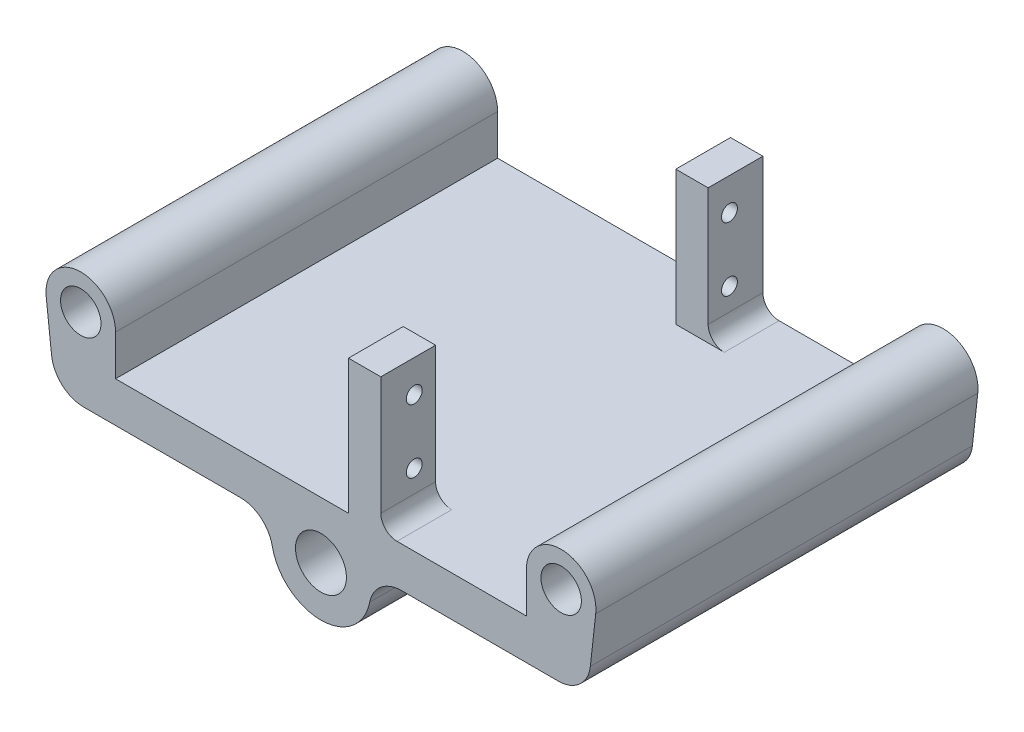
ISO-10303-21;
HEADER;
FILE_DESCRIPTION(('STEP AP214'),'2;1');
FILE_NAME('part.step','',(''),(''),'','','');
FILE_SCHEMA(('AUTOMOTIVE_DESIGN { 1 0 10303 214 1 1 1 1 }'));
ENDSEC;
DATA;
#1=APPLICATION_CONTEXT('core data for automotive mechanical design processes');
#2=APPLICATION_PROTOCOL_DEFINITION('international standard','automotive_design',2000,#1);
#3=PRODUCT_CONTEXT('',#1,'mechanical');
#4=PRODUCT('Part','Part','',(#3));
#5=PRODUCT_RELATED_PRODUCT_CATEGORY('part','',(#4));
#6=PRODUCT_DEFINITION_FORMATION('','',#4);
#7=PRODUCT_DEFINITION_CONTEXT('part definition',#1,'design');
#8=PRODUCT_DEFINITION('design','',#6,#7);
#9=PRODUCT_DEFINITION_SHAPE('','',#8);
#10=(LENGTH_UNIT() NAMED_UNIT(*) SI_UNIT(.MILLI.,.METRE.));
#11=(NAMED_UNIT(*) PLANE_ANGLE_UNIT() SI_UNIT($,.RADIAN.));
#12=(NAMED_UNIT(*) SI_UNIT($,.STERADIAN.) SOLID_ANGLE_UNIT());
#13=UNCERTAINTY_MEASURE_WITH_UNIT(LENGTH_MEASURE(1.E-05),#10,'distance_accuracy_value','');
#14=(GEOMETRIC_REPRESENTATION_CONTEXT(3) GLOBAL_UNCERTAINTY_ASSIGNED_CONTEXT((#13)) GLOBAL_UNIT_ASSIGNED_CONTEXT((#10,
#11,#12)) REPRESENTATION_CONTEXT('',''));
#15=CARTESIAN_POINT('',(0.,0.,0.));
#16=DIRECTION('',(0.,0.,1.));
#17=DIRECTION('',(1.,0.,0.));
#18=AXIS2_PLACEMENT_3D('',#15,#16,#17);
#19=CARTESIAN_POINT('',(32.258,6.35,60.));
#20=DIRECTION('',(0.,-1.,0.));
#21=DIRECTION('',(1.,0.,0.));
#22=AXIS2_PLACEMENT_3D('',#19,#20,#21);
#23=PLANE('',#22);
#24=DIRECTION('',(-1.,0.,0.));
#25=VECTOR('',#24,1.);
#26=CARTESIAN_POINT('',(32.258,6.35,0.));
#27=LINE('',#26,#25);
#28=CARTESIAN_POINT('',(32.258,6.35,0.));
#29=VERTEX_POINT('',#28);
#30=CARTESIAN_POINT('',(11.938,6.35,0.));
#31=VERTEX_POINT('',#30);
#32=EDGE_CURVE('E312',#29,#31,#27,.T.);
#33=ORIENTED_EDGE('',*,*,#32,.T.);
#34=DIRECTION('',(0.,0.,-1.));
#35=VECTOR('',#34,1.);
#36=CARTESIAN_POINT('',(11.938,6.35,8.6));
#37=LINE('',#36,#35);
#38=CARTESIAN_POINT('',(11.938,6.35,8.6));
#39=VERTEX_POINT('',#38);
#40=EDGE_CURVE('E346',#31,#39,#37,.F.);
#41=ORIENTED_EDGE('',*,*,#40,.T.);
#42=DIRECTION('',(1.,0.,0.));
#43=VECTOR('',#42,1.);
#44=CARTESIAN_POINT('',(4.31799999999999,6.35,8.6));
#45=LINE('',#44,#43);
#46=CARTESIAN_POINT('',(4.31799999999999,6.35,8.6));
#47=VERTEX_POINT('',#46);
#48=EDGE_CURVE('E226',#47,#39,#45,.T.);
#49=ORIENTED_EDGE('',*,*,#48,.F.);
#50=DIRECTION('',(0.,0.,1.));
#51=VECTOR('',#50,1.);
#52=CARTESIAN_POINT('',(4.31799999999998,6.35,0.));
#53=LINE('',#52,#51);
#54=CARTESIAN_POINT('',(4.31799999999998,6.35,0.));
#55=VERTEX_POINT('',#54);
#56=EDGE_CURVE('E223',#55,#47,#53,.T.);
#57=ORIENTED_EDGE('',*,*,#56,.F.);
#58=CARTESIAN_POINT('',(-32.258,6.35,0.));
#59=VERTEX_POINT('',#58);
#60=EDGE_CURVE('E330',#55,#59,#27,.T.);
#61=ORIENTED_EDGE('',*,*,#60,.T.);
#62=DIRECTION('',(0.,0.,-1.));
#63=VECTOR('',#62,1.);
#64=CARTESIAN_POINT('',(-32.258,6.35,60.));
#65=LINE('',#64,#63);
#66=CARTESIAN_POINT('',(-32.258,6.35,60.));
#67=VERTEX_POINT('',#66);
#68=EDGE_CURVE('E287',#67,#59,#65,.T.);
#69=ORIENTED_EDGE('',*,*,#68,.F.);
#70=DIRECTION('',(-1.,0.,0.));
#71=VECTOR('',#70,1.);
#72=CARTESIAN_POINT('',(32.258,6.35,60.));
#73=LINE('',#72,#71);
#74=CARTESIAN_POINT('',(4.31799999999998,6.35,60.));
#75=VERTEX_POINT('',#74);
#76=EDGE_CURVE('E318',#75,#67,#73,.T.);
#77=ORIENTED_EDGE('',*,*,#76,.F.);
#78=DIRECTION('',(0.,0.,1.));
#79=VECTOR('',#78,1.);
#80=CARTESIAN_POINT('',(4.31799999999999,6.35,51.4));
#81=LINE('',#80,#79);
#82=CARTESIAN_POINT('',(4.31799999999999,6.35,51.4));
#83=VERTEX_POINT('',#82);
#84=EDGE_CURVE('E222',#83,#75,#81,.T.);
#85=ORIENTED_EDGE('',*,*,#84,.F.);
#86=DIRECTION('',(-1.,0.,0.));
#87=VECTOR('',#86,1.);
#88=CARTESIAN_POINT('',(4.31799999999999,6.35,51.4));
#89=LINE('',#88,#87);
#90=CARTESIAN_POINT('',(11.938,6.35,51.4));
#91=VERTEX_POINT('',#90);
#92=EDGE_CURVE('E218',#91,#83,#89,.T.);
#93=ORIENTED_EDGE('',*,*,#92,.F.);
#94=DIRECTION('',(0.,0.,-1.));
#95=VECTOR('',#94,1.);
#96=CARTESIAN_POINT('',(11.938,6.35,60.));
#97=LINE('',#96,#95);
#98=CARTESIAN_POINT('',(11.938,6.35,60.));
#99=VERTEX_POINT('',#98);
#100=EDGE_CURVE('E344',#91,#99,#97,.F.);
#101=ORIENTED_EDGE('',*,*,#100,.T.);
#102=CARTESIAN_POINT('',(32.258,6.35,60.));
#103=VERTEX_POINT('',#102);
#104=EDGE_CURVE('E319',#103,#99,#73,.T.);
#105=ORIENTED_EDGE('',*,*,#104,.F.);
#106=DIRECTION('',(0.,0.,-1.));
#107=VECTOR('',#106,1.);
#108=CARTESIAN_POINT('',(32.258,6.35,60.));
#109=LINE('',#108,#107);
#110=EDGE_CURVE('E322',#103,#29,#109,.T.);
#111=ORIENTED_EDGE('',*,*,#110,.T.);
#112=EDGE_LOOP('',(#33,#41,#49,#57,#61,#69,#77,#85,#93,#101,#105,#111));
#113=FACE_BOUND('',#112,.T.);
#114=ADVANCED_FACE('F36',(#113),#23,.F.);
#115=CARTESIAN_POINT('',(0.,0.,60.));
#116=DIRECTION('',(0.,-1.,0.));
#117=DIRECTION('',(0.,0.,-1.));
#118=AXIS2_PLACEMENT_3D('',#115,#116,#117);
#119=PLANE('',#118);
#120=DIRECTION('',(-1.,0.,0.));
#121=VECTOR('',#120,1.);
#122=CARTESIAN_POINT('',(0.,0.,60.));
#123=LINE('',#122,#121);
#124=CARTESIAN_POINT('',(-12.6372663183143,0.,60.));
#125=VERTEX_POINT('',#124);
#126=CARTESIAN_POINT('',(-37.2549490920751,0.,60.));
#127=VERTEX_POINT('',#126);
#128=EDGE_CURVE('E270',#125,#127,#123,.T.);
#129=ORIENTED_EDGE('',*,*,#128,.T.);
#130=DIRECTION('',(0.,0.,-1.));
#131=VECTOR('',#130,1.);
#132=CARTESIAN_POINT('',(-37.2549490920751,0.,60.));
#133=LINE('',#132,#131);
#134=CARTESIAN_POINT('',(-37.2549490920751,0.,0.));
#135=VERTEX_POINT('',#134);
#136=EDGE_CURVE('E379',#127,#135,#133,.T.);
#137=ORIENTED_EDGE('',*,*,#136,.T.);
#138=DIRECTION('',(-1.,0.,0.));
#139=VECTOR('',#138,1.);
#140=CARTESIAN_POINT('',(0.,0.,0.));
#141=LINE('',#140,#139);
#142=CARTESIAN_POINT('',(-12.6372663183143,0.,0.));
#143=VERTEX_POINT('',#142);
#144=EDGE_CURVE('E265',#143,#135,#141,.T.);
#145=ORIENTED_EDGE('',*,*,#144,.F.);
#146=DIRECTION('',(0.,0.,1.));
#147=VECTOR('',#146,1.);
#148=CARTESIAN_POINT('',(-12.6372663183143,0.,60.));
#149=LINE('',#148,#147);
#150=EDGE_CURVE('E366',#143,#125,#149,.T.);
#151=ORIENTED_EDGE('',*,*,#150,.T.);
#152=EDGE_LOOP('',(#129,#137,#145,#151));
#153=FACE_BOUND('',#152,.T.);
#154=ADVANCED_FACE('F504',(#153),#119,.T.);
#155=CARTESIAN_POINT('',(37.719,12.7,60.));
#156=DIRECTION('',(0.,0.,1.));
#157=DIRECTION('',(1.,0.,0.));
#158=AXIS2_PLACEMENT_3D('',#155,#156,#157);
#159=PLANE('',#158);
#160=DIRECTION('',(-0.110525955178562,0.99387323800969,0.));
#161=VECTOR('',#160,1.);
#162=CARTESIAN_POINT('',(-41.8013318448109,0.,60.));
#163=LINE('',#162,#161);
#164=CARTESIAN_POINT('',(-42.3038251411643,4.5185281476929,60.));
#165=VERTEX_POINT('',#164);
#166=CARTESIAN_POINT('',(-43.1465417527709,12.0964177587699,60.));
#167=VERTEX_POINT('',#166);
#168=EDGE_CURVE('E268',#165,#167,#163,.T.);
#169=ORIENTED_EDGE('',*,*,#168,.F.);
#170=CARTESIAN_POINT('',(-37.2549490920751,5.08,60.));
#171=DIRECTION('',(0.,0.,1.));
#172=DIRECTION('',(1.,0.,0.));
#173=AXIS2_PLACEMENT_3D('',#170,#171,#172);
#174=CIRCLE('',#173,5.08);
#175=EDGE_CURVE('E389',#165,#127,#174,.T.);
#176=ORIENTED_EDGE('',*,*,#175,.T.);
#177=ORIENTED_EDGE('',*,*,#128,.F.);
#178=CARTESIAN_POINT('',(-12.6372663183143,-5.08,60.));
#179=DIRECTION('',(0.,0.,1.));
#180=DIRECTION('',(1.,0.,0.));
#181=AXIS2_PLACEMENT_3D('',#178,#179,#180);
#182=CIRCLE('',#181,5.08);
#183=CARTESIAN_POINT('',(-7.65686966222144,-4.07897595034911,60.));
#184=VERTEX_POINT('',#183);
#185=EDGE_CURVE('E373',#125,#184,#182,.F.);
#186=ORIENTED_EDGE('',*,*,#185,.T.);
#187=CARTESIAN_POINT('',(0.,-2.54,60.));
#188=DIRECTION('',(0.,0.,1.));
#189=DIRECTION('',(1.,0.,0.));
#190=AXIS2_PLACEMENT_3D('',#187,#188,#189);
#191=CIRCLE('',#190,7.81);
#192=CARTESIAN_POINT('',(7.65686966222144,-4.07897595034911,60.));
#193=VERTEX_POINT('',#192);
#194=EDGE_CURVE('E293',#193,#184,#191,.F.);
#195=ORIENTED_EDGE('',*,*,#194,.F.);
#196=CARTESIAN_POINT('',(12.6372663183143,-5.08,60.));
#197=DIRECTION('',(0.,0.,1.));
#198=DIRECTION('',(1.,0.,0.));
#199=AXIS2_PLACEMENT_3D('',#196,#197,#198);
#200=CIRCLE('',#199,5.08);
#201=CARTESIAN_POINT('',(12.6372663183143,0.,60.));
#202=VERTEX_POINT('',#201);
#203=EDGE_CURVE('E377',#193,#202,#200,.F.);
#204=ORIENTED_EDGE('',*,*,#203,.T.);
#205=DIRECTION('',(1.,0.,0.));
#206=VECTOR('',#205,1.);
#207=CARTESIAN_POINT('',(0.,0.,60.));
#208=LINE('',#207,#206);
#209=CARTESIAN_POINT('',(37.2549490920751,0.,60.));
#210=VERTEX_POINT('',#209);
#211=EDGE_CURVE('E309',#202,#210,#208,.T.);
#212=ORIENTED_EDGE('',*,*,#211,.T.);
#213=CARTESIAN_POINT('',(37.2549490920751,5.08,60.));
#214=DIRECTION('',(0.,0.,1.));
#215=DIRECTION('',(1.,0.,0.));
#216=AXIS2_PLACEMENT_3D('',#213,#214,#215);
#217=CIRCLE('',#216,5.08);
#218=CARTESIAN_POINT('',(42.3038251411643,4.5185281476929,60.));
#219=VERTEX_POINT('',#218);
#220=EDGE_CURVE('E51',#210,#219,#217,.T.);
#221=ORIENTED_EDGE('',*,*,#220,.T.);
#222=DIRECTION('',(0.110525955178562,0.99387323800969,0.));
#223=VECTOR('',#222,1.);
#224=CARTESIAN_POINT('',(41.8013318448109,0.,60.));
#225=LINE('',#224,#223);
#226=CARTESIAN_POINT('',(43.1465417527709,12.0964177587699,60.));
#227=VERTEX_POINT('',#226);
#228=EDGE_CURVE('E311',#219,#227,#225,.T.);
#229=ORIENTED_EDGE('',*,*,#228,.T.);
#230=CARTESIAN_POINT('',(37.719,12.7,60.));
#231=DIRECTION('',(0.,0.,1.));
#232=DIRECTION('',(1.,0.,0.));
#233=AXIS2_PLACEMENT_3D('',#230,#231,#232);
#234=CIRCLE('',#233,5.461);
#235=CARTESIAN_POINT('',(32.258,12.7,60.));
#236=VERTEX_POINT('',#235);
#237=EDGE_CURVE('E314',#227,#236,#234,.T.);
#238=ORIENTED_EDGE('',*,*,#237,.T.);
#239=DIRECTION('',(0.,-1.,0.));
#240=VECTOR('',#239,1.);
#241=CARTESIAN_POINT('',(32.258,12.7,60.));
#242=LINE('',#241,#240);
#243=EDGE_CURVE('E316',#236,#103,#242,.T.);
#244=ORIENTED_EDGE('',*,*,#243,.T.);
#245=ORIENTED_EDGE('',*,*,#104,.T.);
#246=CARTESIAN_POINT('',(11.938,8.89,60.));
#247=DIRECTION('',(0.,0.,1.));
#248=DIRECTION('',(1.,0.,0.));
#249=AXIS2_PLACEMENT_3D('',#246,#247,#248);
#250=CIRCLE('',#249,2.54);
#251=CARTESIAN_POINT('',(9.39799999999999,8.89,60.));
#252=VERTEX_POINT('',#251);
#253=EDGE_CURVE('E359',#99,#252,#250,.F.);
#254=ORIENTED_EDGE('',*,*,#253,.T.);
#255=DIRECTION('',(0.,-1.,0.));
#256=VECTOR('',#255,1.);
#257=CARTESIAN_POINT('',(9.39799999999999,27.45,60.));
#258=LINE('',#257,#256);
#259=CARTESIAN_POINT('',(9.39799999999999,27.45,60.));
#260=VERTEX_POINT('',#259);
#261=EDGE_CURVE('E205',#260,#252,#258,.T.);
#262=ORIENTED_EDGE('',*,*,#261,.F.);
#263=DIRECTION('',(1.,0.,0.));
#264=VECTOR('',#263,1.);
#265=CARTESIAN_POINT('',(4.31799999999998,27.45,60.));
#266=LINE('',#265,#264);
#267=CARTESIAN_POINT('',(4.31799999999998,27.45,60.));
#268=VERTEX_POINT('',#267);
#269=EDGE_CURVE('E196',#268,#260,#266,.T.);
#270=ORIENTED_EDGE('',*,*,#269,.F.);
#271=DIRECTION('',(0.,-1.,0.));
#272=VECTOR('',#271,1.);
#273=CARTESIAN_POINT('',(4.31799999999998,27.45,60.));
#274=LINE('',#273,#272);
#275=EDGE_CURVE('E202',#268,#75,#274,.T.);
#276=ORIENTED_EDGE('',*,*,#275,.T.);
#277=ORIENTED_EDGE('',*,*,#76,.T.);
#278=DIRECTION('',(0.,-1.,0.));
#279=VECTOR('',#278,1.);
#280=CARTESIAN_POINT('',(-32.258,12.7,60.));
#281=LINE('',#280,#279);
#282=CARTESIAN_POINT('',(-32.258,12.7,60.));
#283=VERTEX_POINT('',#282);
#284=EDGE_CURVE('E261',#283,#67,#281,.T.);
#285=ORIENTED_EDGE('',*,*,#284,.F.);
#286=CARTESIAN_POINT('',(-37.719,12.7,60.));
#287=DIRECTION('',(0.,0.,-1.));
#288=DIRECTION('',(-1.,0.,0.));
#289=AXIS2_PLACEMENT_3D('',#286,#287,#288);
#290=CIRCLE('',#289,5.461);
#291=EDGE_CURVE('E264',#167,#283,#290,.T.);
#292=ORIENTED_EDGE('',*,*,#291,.F.);
#293=EDGE_LOOP('',(#169,#176,#177,#186,#195,#204,#212,#221,#229,#238,#244,#245,#254,#262,#270,
#276,#277,#285,#292));
#294=FACE_BOUND('',#293,.T.);
#295=CARTESIAN_POINT('',(37.719,12.7,60.));
#296=DIRECTION('',(0.,0.,1.));
#297=DIRECTION('',(1.,0.,0.));
#298=AXIS2_PLACEMENT_3D('',#295,#296,#297);
#299=CIRCLE('',#298,3.175);
#300=CARTESIAN_POINT('',(40.894,12.7,60.));
#301=VERTEX_POINT('',#300);
#302=EDGE_CURVE('E303',#301,#301,#299,.T.);
#303=ORIENTED_EDGE('',*,*,#302,.F.);
#304=EDGE_LOOP('',(#303));
#305=FACE_BOUND('',#304,.T.);
#306=CARTESIAN_POINT('',(-37.719,12.7,60.));
#307=DIRECTION('',(0.,0.,-1.));
#308=DIRECTION('',(-1.,0.,0.));
#309=AXIS2_PLACEMENT_3D('',#306,#307,#308);
#310=CIRCLE('',#309,3.175);
#311=CARTESIAN_POINT('',(-40.894,12.7,60.));
#312=VERTEX_POINT('',#311);
#313=EDGE_CURVE('E255',#312,#312,#310,.T.);
#314=ORIENTED_EDGE('',*,*,#313,.T.);
#315=EDGE_LOOP('',(#314));
#316=FACE_BOUND('',#315,.T.);
#317=CARTESIAN_POINT('',(0.,-2.54,60.));
#318=DIRECTION('',(0.,0.,-1.));
#319=DIRECTION('',(-1.,0.,0.));
#320=AXIS2_PLACEMENT_3D('',#317,#318,#319);
#321=CIRCLE('',#320,4.);
#322=CARTESIAN_POINT('',(-4.,-2.54,60.));
#323=VERTEX_POINT('',#322);
#324=EDGE_CURVE('E297',#323,#323,#321,.T.);
#325=ORIENTED_EDGE('',*,*,#324,.T.);
#326=EDGE_LOOP('',(#325));
#327=FACE_BOUND('',#326,.T.);
#328=ADVANCED_FACE('F199',(#294,#305,#316,#327),#159,.T.);
#329=CARTESIAN_POINT('',(37.719,12.7,0.));
#330=DIRECTION('',(0.,0.,1.));
#331=DIRECTION('',(1.,0.,0.));
#332=AXIS2_PLACEMENT_3D('',#329,#330,#331);
#333=PLANE('',#332);
#334=ORIENTED_EDGE('',*,*,#144,.T.);
#335=CARTESIAN_POINT('',(-37.2549490920751,5.08,0.));
#336=DIRECTION('',(0.,0.,1.));
#337=DIRECTION('',(1.,0.,0.));
#338=AXIS2_PLACEMENT_3D('',#335,#336,#337);
#339=CIRCLE('',#338,5.08);
#340=CARTESIAN_POINT('',(-42.3038251411643,4.5185281476929,0.));
#341=VERTEX_POINT('',#340);
#342=EDGE_CURVE('E384',#135,#341,#339,.F.);
#343=ORIENTED_EDGE('',*,*,#342,.T.);
#344=DIRECTION('',(-0.110525955178562,0.99387323800969,0.));
#345=VECTOR('',#344,1.);
#346=CARTESIAN_POINT('',(-41.8013318448109,0.,0.));
#347=LINE('',#346,#345);
#348=CARTESIAN_POINT('',(-43.1465417527709,12.0964177587699,0.));
#349=VERTEX_POINT('',#348);
#350=EDGE_CURVE('E279',#341,#349,#347,.T.);
#351=ORIENTED_EDGE('',*,*,#350,.T.);
#352=CARTESIAN_POINT('',(-37.719,12.7,0.));
#353=DIRECTION('',(0.,0.,-1.));
#354=DIRECTION('',(-1.,0.,0.));
#355=AXIS2_PLACEMENT_3D('',#352,#353,#354);
#356=CIRCLE('',#355,5.461);
#357=CARTESIAN_POINT('',(-32.258,12.7,0.));
#358=VERTEX_POINT('',#357);
#359=EDGE_CURVE('E276',#349,#358,#356,.T.);
#360=ORIENTED_EDGE('',*,*,#359,.T.);
#361=DIRECTION('',(0.,-1.,0.));
#362=VECTOR('',#361,1.);
#363=CARTESIAN_POINT('',(-32.258,12.7,0.));
#364=LINE('',#363,#362);
#365=EDGE_CURVE('E258',#358,#59,#364,.T.);
#366=ORIENTED_EDGE('',*,*,#365,.T.);
#367=ORIENTED_EDGE('',*,*,#60,.F.);
#368=DIRECTION('',(0.,-1.,0.));
#369=VECTOR('',#368,1.);
#370=CARTESIAN_POINT('',(4.31799999999998,27.45,0.));
#371=LINE('',#370,#369);
#372=CARTESIAN_POINT('',(4.31799999999998,27.45,0.));
#373=VERTEX_POINT('',#372);
#374=EDGE_CURVE('E240',#373,#55,#371,.T.);
#375=ORIENTED_EDGE('',*,*,#374,.F.);
#376=DIRECTION('',(-1.,0.,0.));
#377=VECTOR('',#376,1.);
#378=CARTESIAN_POINT('',(4.31799999999998,27.45,0.));
#379=LINE('',#378,#377);
#380=CARTESIAN_POINT('',(9.39799999999998,27.45,0.));
#381=VERTEX_POINT('',#380);
#382=EDGE_CURVE('E239',#381,#373,#379,.T.);
#383=ORIENTED_EDGE('',*,*,#382,.F.);
#384=DIRECTION('',(0.,-1.,0.));
#385=VECTOR('',#384,1.);
#386=CARTESIAN_POINT('',(9.39799999999998,27.45,0.));
#387=LINE('',#386,#385);
#388=CARTESIAN_POINT('',(9.39799999999999,8.89,0.));
#389=VERTEX_POINT('',#388);
#390=EDGE_CURVE('E245',#381,#389,#387,.T.);
#391=ORIENTED_EDGE('',*,*,#390,.T.);
#392=CARTESIAN_POINT('',(11.938,8.89,0.));
#393=DIRECTION('',(0.,0.,1.));
#394=DIRECTION('',(1.,0.,0.));
#395=AXIS2_PLACEMENT_3D('',#392,#393,#394);
#396=CIRCLE('',#395,2.54);
#397=EDGE_CURVE('E352',#389,#31,#396,.T.);
#398=ORIENTED_EDGE('',*,*,#397,.T.);
#399=ORIENTED_EDGE('',*,*,#32,.F.);
#400=DIRECTION('',(0.,-1.,0.));
#401=VECTOR('',#400,1.);
#402=CARTESIAN_POINT('',(32.258,12.7,0.));
#403=LINE('',#402,#401);
#404=CARTESIAN_POINT('',(32.258,12.7,0.));
#405=VERTEX_POINT('',#404);
#406=EDGE_CURVE('E328',#405,#29,#403,.T.);
#407=ORIENTED_EDGE('',*,*,#406,.F.);
#408=CARTESIAN_POINT('',(37.719,12.7,0.));
#409=DIRECTION('',(0.,0.,1.));
#410=DIRECTION('',(1.,0.,0.));
#411=AXIS2_PLACEMENT_3D('',#408,#409,#410);
#412=CIRCLE('',#411,5.461);
#413=CARTESIAN_POINT('',(43.1465417527709,12.0964177587699,0.));
#414=VERTEX_POINT('',#413);
#415=EDGE_CURVE('E326',#414,#405,#412,.T.);
#416=ORIENTED_EDGE('',*,*,#415,.F.);
#417=DIRECTION('',(0.110525955178562,0.99387323800969,0.));
#418=VECTOR('',#417,1.);
#419=CARTESIAN_POINT('',(41.8013318448109,0.,0.));
#420=LINE('',#419,#418);
#421=CARTESIAN_POINT('',(42.3038251411643,4.5185281476929,0.));
#422=VERTEX_POINT('',#421);
#423=EDGE_CURVE('E324',#422,#414,#420,.T.);
#424=ORIENTED_EDGE('',*,*,#423,.F.);
#425=CARTESIAN_POINT('',(37.2549490920751,5.08,0.));
#426=DIRECTION('',(0.,0.,1.));
#427=DIRECTION('',(1.,0.,0.));
#428=AXIS2_PLACEMENT_3D('',#425,#426,#427);
#429=CIRCLE('',#428,5.08);
#430=CARTESIAN_POINT('',(37.2549490920751,0.,0.));
#431=VERTEX_POINT('',#430);
#432=EDGE_CURVE('E382',#422,#431,#429,.F.);
#433=ORIENTED_EDGE('',*,*,#432,.T.);
#434=DIRECTION('',(1.,0.,0.));
#435=VECTOR('',#434,1.);
#436=CARTESIAN_POINT('',(0.,0.,0.));
#437=LINE('',#436,#435);
#438=CARTESIAN_POINT('',(12.6372663183143,0.,0.));
#439=VERTEX_POINT('',#438);
#440=EDGE_CURVE('E306',#439,#431,#437,.T.);
#441=ORIENTED_EDGE('',*,*,#440,.F.);
#442=CARTESIAN_POINT('',(12.6372663183143,-5.08,0.));
#443=DIRECTION('',(0.,0.,1.));
#444=DIRECTION('',(1.,0.,0.));
#445=AXIS2_PLACEMENT_3D('',#442,#443,#444);
#446=CIRCLE('',#445,5.08);
#447=CARTESIAN_POINT('',(7.65686966222144,-4.07897595034911,0.));
#448=VERTEX_POINT('',#447);
#449=EDGE_CURVE('E375',#439,#448,#446,.T.);
#450=ORIENTED_EDGE('',*,*,#449,.T.);
#451=CARTESIAN_POINT('',(0.,-2.54,0.));
#452=DIRECTION('',(0.,0.,-1.));
#453=DIRECTION('',(-1.,0.,0.));
#454=AXIS2_PLACEMENT_3D('',#451,#452,#453);
#455=CIRCLE('',#454,7.81);
#456=CARTESIAN_POINT('',(-7.65686966222144,-4.07897595034911,0.));
#457=VERTEX_POINT('',#456);
#458=EDGE_CURVE('E290',#448,#457,#455,.T.);
#459=ORIENTED_EDGE('',*,*,#458,.T.);
#460=CARTESIAN_POINT('',(-12.6372663183143,-5.08,0.));
#461=DIRECTION('',(0.,0.,1.));
#462=DIRECTION('',(1.,0.,0.));
#463=AXIS2_PLACEMENT_3D('',#460,#461,#462);
#464=CIRCLE('',#463,5.08);
#465=EDGE_CURVE('E371',#457,#143,#464,.T.);
#466=ORIENTED_EDGE('',*,*,#465,.T.);
#467=EDGE_LOOP('',(#334,#343,#351,#360,#366,#367,#375,#383,#391,#398,#399,#407,#416,#424,#433,
#441,#450,#459,#466));
#468=FACE_BOUND('',#467,.T.);
#469=CARTESIAN_POINT('',(-37.719,12.7,0.));
#470=DIRECTION('',(0.,0.,-1.));
#471=DIRECTION('',(-1.,0.,0.));
#472=AXIS2_PLACEMENT_3D('',#469,#470,#471);
#473=CIRCLE('',#472,3.175);
#474=CARTESIAN_POINT('',(-40.894,12.7,0.));
#475=VERTEX_POINT('',#474);
#476=EDGE_CURVE('E254',#475,#475,#473,.T.);
#477=ORIENTED_EDGE('',*,*,#476,.F.);
#478=EDGE_LOOP('',(#477));
#479=FACE_BOUND('',#478,.T.);
#480=CARTESIAN_POINT('',(37.719,12.7,0.));
#481=DIRECTION('',(0.,0.,1.));
#482=DIRECTION('',(1.,0.,0.));
#483=AXIS2_PLACEMENT_3D('',#480,#481,#482);
#484=CIRCLE('',#483,3.175);
#485=CARTESIAN_POINT('',(40.894,12.7,0.));
#486=VERTEX_POINT('',#485);
#487=EDGE_CURVE('E300',#486,#486,#484,.T.);
#488=ORIENTED_EDGE('',*,*,#487,.T.);
#489=EDGE_LOOP('',(#488));
#490=FACE_BOUND('',#489,.T.);
#491=CARTESIAN_POINT('',(0.,-2.54,0.));
#492=DIRECTION('',(0.,0.,-1.));
#493=DIRECTION('',(-1.,0.,0.));
#494=AXIS2_PLACEMENT_3D('',#491,#492,#493);
#495=CIRCLE('',#494,4.);
#496=CARTESIAN_POINT('',(-4.,-2.54,0.));
#497=VERTEX_POINT('',#496);
#498=EDGE_CURVE('E296',#497,#497,#495,.T.);
#499=ORIENTED_EDGE('',*,*,#498,.F.);
#500=EDGE_LOOP('',(#499));
#501=FACE_BOUND('',#500,.T.);
#502=ADVANCED_FACE('F399',(#468,#479,#490,#501),#333,.F.);
#503=CARTESIAN_POINT('',(0.,0.,60.));
#504=DIRECTION('',(0.,1.,0.));
#505=DIRECTION('',(0.,0.,1.));
#506=AXIS2_PLACEMENT_3D('',#503,#504,#505);
#507=PLANE('',#506);
#508=ORIENTED_EDGE('',*,*,#440,.T.);
#509=DIRECTION('',(0.,0.,-1.));
#510=VECTOR('',#509,1.);
#511=CARTESIAN_POINT('',(37.2549490920751,0.,60.));
#512=LINE('',#511,#510);
#513=EDGE_CURVE('E11',#431,#210,#512,.F.);
#514=ORIENTED_EDGE('',*,*,#513,.T.);
#515=ORIENTED_EDGE('',*,*,#211,.F.);
#516=DIRECTION('',(0.,0.,-1.));
#517=VECTOR('',#516,1.);
#518=CARTESIAN_POINT('',(12.6372663183143,0.,60.));
#519=LINE('',#518,#517);
#520=EDGE_CURVE('E368',#202,#439,#519,.T.);
#521=ORIENTED_EDGE('',*,*,#520,.T.);
#522=EDGE_LOOP('',(#508,#514,#515,#521));
#523=FACE_BOUND('',#522,.T.);
#524=ADVANCED_FACE('F519',(#523),#507,.F.);
#525=CARTESIAN_POINT('',(41.8013318448109,0.,60.));
#526=DIRECTION('',(-0.99387323800969,0.110525955178562,0.));
#527=DIRECTION('',(-0.110525955178562,-0.99387323800969,0.));
#528=AXIS2_PLACEMENT_3D('',#525,#526,#527);
#529=PLANE('',#528);
#530=ORIENTED_EDGE('',*,*,#228,.F.);
#531=DIRECTION('',(0.,0.,-1.));
#532=VECTOR('',#531,1.);
#533=CARTESIAN_POINT('',(42.3038251411643,4.5185281476929,60.));
#534=LINE('',#533,#532);
#535=EDGE_CURVE('E44',#219,#422,#534,.T.);
#536=ORIENTED_EDGE('',*,*,#535,.T.);
#537=ORIENTED_EDGE('',*,*,#423,.T.);
#538=DIRECTION('',(0.,0.,-1.));
#539=VECTOR('',#538,1.);
#540=CARTESIAN_POINT('',(43.1465417527709,12.0964177587699,60.));
#541=LINE('',#540,#539);
#542=EDGE_CURVE('E338',#227,#414,#541,.T.);
#543=ORIENTED_EDGE('',*,*,#542,.F.);
#544=EDGE_LOOP('',(#530,#536,#537,#543));
#545=FACE_BOUND('',#544,.T.);
#546=ADVANCED_FACE('F394',(#545),#529,.F.);
#547=CARTESIAN_POINT('',(37.719,12.7,60.));
#548=DIRECTION('',(0.,0.,-1.));
#549=DIRECTION('',(-1.,0.,0.));
#550=AXIS2_PLACEMENT_3D('',#547,#548,#549);
#551=CYLINDRICAL_SURFACE('',#550,5.461);
#552=ORIENTED_EDGE('',*,*,#415,.T.);
#553=DIRECTION('',(0.,0.,-1.));
#554=VECTOR('',#553,1.);
#555=CARTESIAN_POINT('',(32.258,12.7,60.));
#556=LINE('',#555,#554);
#557=EDGE_CURVE('E335',#236,#405,#556,.T.);
#558=ORIENTED_EDGE('',*,*,#557,.F.);
#559=ORIENTED_EDGE('',*,*,#237,.F.);
#560=ORIENTED_EDGE('',*,*,#542,.T.);
#561=EDGE_LOOP('',(#552,#558,#559,#560));
#562=FACE_BOUND('',#561,.T.);
#563=ADVANCED_FACE('F406',(#562),#551,.T.);
#564=CARTESIAN_POINT('',(32.258,12.7,60.));
#565=DIRECTION('',(1.,0.,0.));
#566=DIRECTION('',(0.,0.,-1.));
#567=AXIS2_PLACEMENT_3D('',#564,#565,#566);
#568=PLANE('',#567);
#569=ORIENTED_EDGE('',*,*,#406,.T.);
#570=ORIENTED_EDGE('',*,*,#110,.F.);
#571=ORIENTED_EDGE('',*,*,#243,.F.);
#572=ORIENTED_EDGE('',*,*,#557,.T.);
#573=EDGE_LOOP('',(#569,#570,#571,#572));
#574=FACE_BOUND('',#573,.T.);
#575=ADVANCED_FACE('F410',(#574),#568,.F.);
#576=CARTESIAN_POINT('',(37.719,12.7,60.));
#577=DIRECTION('',(0.,0.,-1.));
#578=DIRECTION('',(-1.,0.,0.));
#579=AXIS2_PLACEMENT_3D('',#576,#577,#578);
#580=CYLINDRICAL_SURFACE('',#579,3.175);
#581=ORIENTED_EDGE('',*,*,#302,.T.);
#582=EDGE_LOOP('',(#581));
#583=FACE_BOUND('',#582,.T.);
#584=ORIENTED_EDGE('',*,*,#487,.F.);
#585=EDGE_LOOP('',(#584));
#586=FACE_BOUND('',#585,.T.);
#587=ADVANCED_FACE('F535',(#583,#586),#580,.F.);
#588=CARTESIAN_POINT('',(0.,-2.54,60.));
#589=DIRECTION('',(0.,0.,-1.));
#590=DIRECTION('',(-1.,0.,0.));
#591=AXIS2_PLACEMENT_3D('',#588,#589,#590);
#592=CYLINDRICAL_SURFACE('',#591,4.);
#593=ORIENTED_EDGE('',*,*,#324,.F.);
#594=EDGE_LOOP('',(#593));
#595=FACE_BOUND('',#594,.T.);
#596=ORIENTED_EDGE('',*,*,#498,.T.);
#597=EDGE_LOOP('',(#596));
#598=FACE_BOUND('',#597,.T.);
#599=ADVANCED_FACE('F617',(#595,#598),#592,.F.);
#600=CARTESIAN_POINT('',(0.,-2.54,72.9660556839773));
#601=DIRECTION('',(0.,0.,-1.));
#602=DIRECTION('',(-1.,0.,0.));
#603=AXIS2_PLACEMENT_3D('',#600,#601,#602);
#604=CYLINDRICAL_SURFACE('',#603,7.81);
#605=ORIENTED_EDGE('',*,*,#194,.T.);
#606=DIRECTION('',(0.,0.,-1.));
#607=VECTOR('',#606,1.);
#608=CARTESIAN_POINT('',(-7.65686966222144,-4.07897595034911,72.9660556839773));
#609=LINE('',#608,#607);
#610=EDGE_CURVE('E363',#184,#457,#609,.T.);
#611=ORIENTED_EDGE('',*,*,#610,.T.);
#612=ORIENTED_EDGE('',*,*,#458,.F.);
#613=DIRECTION('',(0.,0.,-1.));
#614=VECTOR('',#613,1.);
#615=CARTESIAN_POINT('',(7.65686966222144,-4.07897595034911,72.9660556839773));
#616=LINE('',#615,#614);
#617=EDGE_CURVE('E361',#448,#193,#616,.F.);
#618=ORIENTED_EDGE('',*,*,#617,.T.);
#619=EDGE_LOOP('',(#605,#611,#612,#618));
#620=FACE_BOUND('',#619,.T.);
#621=ADVANCED_FACE('F512',(#620),#604,.T.);
#622=CARTESIAN_POINT('',(-32.258,12.7,60.));
#623=DIRECTION('',(1.,0.,0.));
#624=DIRECTION('',(0.,0.,-1.));
#625=AXIS2_PLACEMENT_3D('',#622,#623,#624);
#626=PLANE('',#625);
#627=ORIENTED_EDGE('',*,*,#365,.F.);
#628=DIRECTION('',(0.,0.,-1.));
#629=VECTOR('',#628,1.);
#630=CARTESIAN_POINT('',(-32.258,12.7,60.));
#631=LINE('',#630,#629);
#632=EDGE_CURVE('E285',#283,#358,#631,.T.);
#633=ORIENTED_EDGE('',*,*,#632,.F.);
#634=ORIENTED_EDGE('',*,*,#284,.T.);
#635=ORIENTED_EDGE('',*,*,#68,.T.);
#636=EDGE_LOOP('',(#627,#633,#634,#635));
#637=FACE_BOUND('',#636,.T.);
#638=ADVANCED_FACE('F486',(#637),#626,.T.);
#639=CARTESIAN_POINT('',(-37.719,12.7,60.));
#640=DIRECTION('',(0.,0.,-1.));
#641=DIRECTION('',(-1.,0.,0.));
#642=AXIS2_PLACEMENT_3D('',#639,#640,#641);
#643=CYLINDRICAL_SURFACE('',#642,5.461);
#644=ORIENTED_EDGE('',*,*,#359,.F.);
#645=DIRECTION('',(0.,0.,-1.));
#646=VECTOR('',#645,1.);
#647=CARTESIAN_POINT('',(-43.1465417527709,12.0964177587699,60.));
#648=LINE('',#647,#646);
#649=EDGE_CURVE('E273',#167,#349,#648,.T.);
#650=ORIENTED_EDGE('',*,*,#649,.F.);
#651=ORIENTED_EDGE('',*,*,#291,.T.);
#652=ORIENTED_EDGE('',*,*,#632,.T.);
#653=EDGE_LOOP('',(#644,#650,#651,#652));
#654=FACE_BOUND('',#653,.T.);
#655=ADVANCED_FACE('F492',(#654),#643,.T.);
#656=CARTESIAN_POINT('',(-41.8013318448109,0.,60.));
#657=DIRECTION('',(-0.99387323800969,-0.110525955178562,0.));
#658=DIRECTION('',(0.110525955178562,-0.99387323800969,0.));
#659=AXIS2_PLACEMENT_3D('',#656,#657,#658);
#660=PLANE('',#659);
#661=ORIENTED_EDGE('',*,*,#350,.F.);
#662=DIRECTION('',(0.,0.,-1.));
#663=VECTOR('',#662,1.);
#664=CARTESIAN_POINT('',(-42.3038251411643,4.51852814769291,60.));
#665=LINE('',#664,#663);
#666=EDGE_CURVE('E386',#341,#165,#665,.F.);
#667=ORIENTED_EDGE('',*,*,#666,.T.);
#668=ORIENTED_EDGE('',*,*,#168,.T.);
#669=ORIENTED_EDGE('',*,*,#649,.T.);
#670=EDGE_LOOP('',(#661,#667,#668,#669));
#671=FACE_BOUND('',#670,.T.);
#672=ADVANCED_FACE('F495',(#671),#660,.T.);
#673=CARTESIAN_POINT('',(-37.719,12.7,60.));
#674=DIRECTION('',(0.,0.,-1.));
#675=DIRECTION('',(-1.,0.,0.));
#676=AXIS2_PLACEMENT_3D('',#673,#674,#675);
#677=CYLINDRICAL_SURFACE('',#676,3.175);
#678=ORIENTED_EDGE('',*,*,#313,.F.);
#679=EDGE_LOOP('',(#678));
#680=FACE_BOUND('',#679,.T.);
#681=ORIENTED_EDGE('',*,*,#476,.T.);
#682=EDGE_LOOP('',(#681));
#683=FACE_BOUND('',#682,.T.);
#684=ADVANCED_FACE('F572',(#680,#683),#677,.F.);
#685=CARTESIAN_POINT('',(4.31799999999998,27.45,0.));
#686=DIRECTION('',(1.,0.,0.));
#687=DIRECTION('',(0.,0.,-1.));
#688=AXIS2_PLACEMENT_3D('',#685,#686,#687);
#689=PLANE('',#688);
#690=CARTESIAN_POINT('',(4.31799999999998,12.4,5.24999999999999));
#691=DIRECTION('',(1.,0.,0.));
#692=DIRECTION('',(0.,0.,-1.));
#693=AXIS2_PLACEMENT_3D('',#690,#691,#692);
#694=CIRCLE('',#693,1.25);
#695=CARTESIAN_POINT('',(4.31799999999998,12.4,3.99999999999999));
#696=VERTEX_POINT('',#695);
#697=EDGE_CURVE('E442',#696,#696,#694,.F.);
#698=ORIENTED_EDGE('',*,*,#697,.F.);
#699=EDGE_LOOP('',(#698));
#700=FACE_BOUND('',#699,.T.);
#701=CARTESIAN_POINT('',(4.31799999999998,22.4,5.24999999999999));
#702=DIRECTION('',(1.,0.,0.));
#703=DIRECTION('',(0.,0.,-1.));
#704=AXIS2_PLACEMENT_3D('',#701,#702,#703);
#705=CIRCLE('',#704,1.25);
#706=CARTESIAN_POINT('',(4.31799999999998,22.4,3.99999999999999));
#707=VERTEX_POINT('',#706);
#708=EDGE_CURVE('E438',#707,#707,#705,.F.);
#709=ORIENTED_EDGE('',*,*,#708,.F.);
#710=EDGE_LOOP('',(#709));
#711=FACE_BOUND('',#710,.T.);
#712=ORIENTED_EDGE('',*,*,#56,.T.);
#713=DIRECTION('',(0.,-1.,0.));
#714=VECTOR('',#713,1.);
#715=CARTESIAN_POINT('',(4.31799999999998,27.45,8.6));
#716=LINE('',#715,#714);
#717=CARTESIAN_POINT('',(4.31799999999998,27.45,8.6));
#718=VERTEX_POINT('',#717);
#719=EDGE_CURVE('E251',#718,#47,#716,.T.);
#720=ORIENTED_EDGE('',*,*,#719,.F.);
#721=DIRECTION('',(0.,0.,1.));
#722=VECTOR('',#721,1.);
#723=CARTESIAN_POINT('',(4.31799999999998,27.45,0.));
#724=LINE('',#723,#722);
#725=EDGE_CURVE('E232',#373,#718,#724,.T.);
#726=ORIENTED_EDGE('',*,*,#725,.F.);
#727=ORIENTED_EDGE('',*,*,#374,.T.);
#728=EDGE_LOOP('',(#712,#720,#726,#727));
#729=FACE_BOUND('',#728,.T.);
#730=ADVANCED_FACE('F481',(#700,#711,#729),#689,.F.);
#731=CARTESIAN_POINT('',(4.31799999999998,27.45,8.6));
#732=DIRECTION('',(0.,0.,-1.));
#733=DIRECTION('',(-1.,0.,0.));
#734=AXIS2_PLACEMENT_3D('',#731,#732,#733);
#735=PLANE('',#734);
#736=ORIENTED_EDGE('',*,*,#48,.T.);
#737=CARTESIAN_POINT('',(11.938,8.89,8.6));
#738=DIRECTION('',(0.,0.,-1.));
#739=DIRECTION('',(-1.,0.,0.));
#740=AXIS2_PLACEMENT_3D('',#737,#738,#739);
#741=CIRCLE('',#740,2.54);
#742=CARTESIAN_POINT('',(9.39799999999998,8.89,8.6));
#743=VERTEX_POINT('',#742);
#744=EDGE_CURVE('E354',#39,#743,#741,.T.);
#745=ORIENTED_EDGE('',*,*,#744,.T.);
#746=DIRECTION('',(0.,-1.,0.));
#747=VECTOR('',#746,1.);
#748=CARTESIAN_POINT('',(9.39799999999998,27.45,8.6));
#749=LINE('',#748,#747);
#750=CARTESIAN_POINT('',(9.39799999999998,27.45,8.6));
#751=VERTEX_POINT('',#750);
#752=EDGE_CURVE('E248',#751,#743,#749,.T.);
#753=ORIENTED_EDGE('',*,*,#752,.F.);
#754=DIRECTION('',(1.,0.,0.));
#755=VECTOR('',#754,1.);
#756=CARTESIAN_POINT('',(4.31799999999998,27.45,8.6));
#757=LINE('',#756,#755);
#758=EDGE_CURVE('E235',#718,#751,#757,.T.);
#759=ORIENTED_EDGE('',*,*,#758,.F.);
#760=ORIENTED_EDGE('',*,*,#719,.T.);
#761=EDGE_LOOP('',(#736,#745,#753,#759,#760));
#762=FACE_BOUND('',#761,.T.);
#763=ADVANCED_FACE('F464',(#762),#735,.F.);
#764=CARTESIAN_POINT('',(9.39799999999998,27.45,0.));
#765=DIRECTION('',(-1.,0.,0.));
#766=DIRECTION('',(0.,0.,1.));
#767=AXIS2_PLACEMENT_3D('',#764,#765,#766);
#768=PLANE('',#767);
#769=CARTESIAN_POINT('',(9.39799999999997,12.4,5.24999999999999));
#770=DIRECTION('',(1.,0.,0.));
#771=DIRECTION('',(0.,0.,-1.));
#772=AXIS2_PLACEMENT_3D('',#769,#770,#771);
#773=CIRCLE('',#772,1.25);
#774=CARTESIAN_POINT('',(9.39799999999997,12.4,3.99999999999999));
#775=VERTEX_POINT('',#774);
#776=EDGE_CURVE('E446',#775,#775,#773,.T.);
#777=ORIENTED_EDGE('',*,*,#776,.F.);
#778=EDGE_LOOP('',(#777));
#779=FACE_BOUND('',#778,.T.);
#780=CARTESIAN_POINT('',(9.39799999999996,22.4,5.24999999999999));
#781=DIRECTION('',(1.,0.,0.));
#782=DIRECTION('',(0.,0.,-1.));
#783=AXIS2_PLACEMENT_3D('',#780,#781,#782);
#784=CIRCLE('',#783,1.25);
#785=CARTESIAN_POINT('',(9.39799999999996,22.4,3.99999999999999));
#786=VERTEX_POINT('',#785);
#787=EDGE_CURVE('E449',#786,#786,#784,.T.);
#788=ORIENTED_EDGE('',*,*,#787,.F.);
#789=EDGE_LOOP('',(#788));
#790=FACE_BOUND('',#789,.T.);
#791=ORIENTED_EDGE('',*,*,#752,.T.);
#792=DIRECTION('',(0.,0.,-1.));
#793=VECTOR('',#792,1.);
#794=CARTESIAN_POINT('',(9.39799999999999,8.89,0.));
#795=LINE('',#794,#793);
#796=EDGE_CURVE('E341',#743,#389,#795,.T.);
#797=ORIENTED_EDGE('',*,*,#796,.T.);
#798=ORIENTED_EDGE('',*,*,#390,.F.);
#799=DIRECTION('',(0.,0.,-1.));
#800=VECTOR('',#799,1.);
#801=CARTESIAN_POINT('',(9.39799999999998,27.45,0.));
#802=LINE('',#801,#800);
#803=EDGE_CURVE('E237',#751,#381,#802,.T.);
#804=ORIENTED_EDGE('',*,*,#803,.F.);
#805=EDGE_LOOP('',(#791,#797,#798,#804));
#806=FACE_BOUND('',#805,.T.);
#807=ADVANCED_FACE('F460',(#779,#790,#806),#768,.F.);
#808=CARTESIAN_POINT('',(0.,27.45,0.));
#809=DIRECTION('',(0.,1.,0.));
#810=DIRECTION('',(0.,0.,1.));
#811=AXIS2_PLACEMENT_3D('',#808,#809,#810);
#812=PLANE('',#811);
#813=ORIENTED_EDGE('',*,*,#725,.T.);
#814=ORIENTED_EDGE('',*,*,#758,.T.);
#815=ORIENTED_EDGE('',*,*,#803,.T.);
#816=ORIENTED_EDGE('',*,*,#382,.T.);
#817=EDGE_LOOP('',(#813,#814,#815,#816));
#818=FACE_BOUND('',#817,.T.);
#819=ADVANCED_FACE('F463',(#818),#812,.T.);
#820=CARTESIAN_POINT('',(4.31799999999998,27.45,51.4));
#821=DIRECTION('',(1.,0.,0.));
#822=DIRECTION('',(0.,0.,-1.));
#823=AXIS2_PLACEMENT_3D('',#820,#821,#822);
#824=PLANE('',#823);
#825=CARTESIAN_POINT('',(4.31799999999998,12.4,54.75));
#826=DIRECTION('',(1.,0.,0.));
#827=DIRECTION('',(0.,0.,-1.));
#828=AXIS2_PLACEMENT_3D('',#825,#826,#827);
#829=CIRCLE('',#828,1.25);
#830=CARTESIAN_POINT('',(4.31799999999998,12.4,53.5));
#831=VERTEX_POINT('',#830);
#832=EDGE_CURVE('E443',#831,#831,#829,.F.);
#833=ORIENTED_EDGE('',*,*,#832,.F.);
#834=EDGE_LOOP('',(#833));
#835=FACE_BOUND('',#834,.T.);
#836=CARTESIAN_POINT('',(4.31799999999998,22.4,54.75));
#837=DIRECTION('',(1.,0.,0.));
#838=DIRECTION('',(0.,0.,-1.));
#839=AXIS2_PLACEMENT_3D('',#836,#837,#838);
#840=CIRCLE('',#839,1.25);
#841=CARTESIAN_POINT('',(4.31799999999998,22.4,53.5));
#842=VERTEX_POINT('',#841);
#843=EDGE_CURVE('E430',#842,#842,#840,.F.);
#844=ORIENTED_EDGE('',*,*,#843,.F.);
#845=EDGE_LOOP('',(#844));
#846=FACE_BOUND('',#845,.T.);
#847=ORIENTED_EDGE('',*,*,#84,.T.);
#848=ORIENTED_EDGE('',*,*,#275,.F.);
#849=DIRECTION('',(0.,0.,1.));
#850=VECTOR('',#849,1.);
#851=CARTESIAN_POINT('',(4.31799999999998,27.45,51.4));
#852=LINE('',#851,#850);
#853=CARTESIAN_POINT('',(4.31799999999998,27.45,51.4));
#854=VERTEX_POINT('',#853);
#855=EDGE_CURVE('E209',#854,#268,#852,.T.);
#856=ORIENTED_EDGE('',*,*,#855,.F.);
#857=DIRECTION('',(0.,-1.,0.));
#858=VECTOR('',#857,1.);
#859=CARTESIAN_POINT('',(4.31799999999998,27.45,51.4));
#860=LINE('',#859,#858);
#861=EDGE_CURVE('E425',#854,#83,#860,.T.);
#862=ORIENTED_EDGE('',*,*,#861,.T.);
#863=EDGE_LOOP('',(#847,#848,#856,#862));
#864=FACE_BOUND('',#863,.T.);
#865=ADVANCED_FACE('F220',(#835,#846,#864),#824,.F.);
#866=CARTESIAN_POINT('',(9.39799999999998,27.45,51.4));
#867=DIRECTION('',(-1.,0.,0.));
#868=DIRECTION('',(0.,0.,1.));
#869=AXIS2_PLACEMENT_3D('',#866,#867,#868);
#870=PLANE('',#869);
#871=CARTESIAN_POINT('',(9.39799999999998,12.4,54.75));
#872=DIRECTION('',(1.,0.,0.));
#873=DIRECTION('',(0.,0.,-1.));
#874=AXIS2_PLACEMENT_3D('',#871,#872,#873);
#875=CIRCLE('',#874,1.25);
#876=CARTESIAN_POINT('',(9.39799999999998,12.4,53.5));
#877=VERTEX_POINT('',#876);
#878=EDGE_CURVE('E439',#877,#877,#875,.T.);
#879=ORIENTED_EDGE('',*,*,#878,.F.);
#880=EDGE_LOOP('',(#879));
#881=FACE_BOUND('',#880,.T.);
#882=CARTESIAN_POINT('',(9.39799999999997,22.4,54.75));
#883=DIRECTION('',(1.,0.,0.));
#884=DIRECTION('',(0.,0.,-1.));
#885=AXIS2_PLACEMENT_3D('',#882,#883,#884);
#886=CIRCLE('',#885,1.25);
#887=CARTESIAN_POINT('',(9.39799999999997,22.4,53.5));
#888=VERTEX_POINT('',#887);
#889=EDGE_CURVE('E435',#888,#888,#886,.T.);
#890=ORIENTED_EDGE('',*,*,#889,.F.);
#891=EDGE_LOOP('',(#890));
#892=FACE_BOUND('',#891,.T.);
#893=ORIENTED_EDGE('',*,*,#261,.T.);
#894=DIRECTION('',(0.,0.,-1.));
#895=VECTOR('',#894,1.);
#896=CARTESIAN_POINT('',(9.39799999999998,8.89,51.4));
#897=LINE('',#896,#895);
#898=CARTESIAN_POINT('',(9.39799999999998,8.89,51.4));
#899=VERTEX_POINT('',#898);
#900=EDGE_CURVE('E349',#252,#899,#897,.T.);
#901=ORIENTED_EDGE('',*,*,#900,.T.);
#902=DIRECTION('',(0.,-1.,0.));
#903=VECTOR('',#902,1.);
#904=CARTESIAN_POINT('',(9.39799999999998,27.45,51.4));
#905=LINE('',#904,#903);
#906=CARTESIAN_POINT('',(9.39799999999998,27.45,51.4));
#907=VERTEX_POINT('',#906);
#908=EDGE_CURVE('E228',#907,#899,#905,.T.);
#909=ORIENTED_EDGE('',*,*,#908,.F.);
#910=DIRECTION('',(0.,0.,-1.));
#911=VECTOR('',#910,1.);
#912=CARTESIAN_POINT('',(9.39799999999998,27.45,51.4));
#913=LINE('',#912,#911);
#914=EDGE_CURVE('E208',#260,#907,#913,.T.);
#915=ORIENTED_EDGE('',*,*,#914,.F.);
#916=EDGE_LOOP('',(#893,#901,#909,#915));
#917=FACE_BOUND('',#916,.T.);
#918=ADVANCED_FACE('F422',(#881,#892,#917),#870,.F.);
#919=CARTESIAN_POINT('',(4.31799999999998,27.45,51.4));
#920=DIRECTION('',(0.,0.,1.));
#921=DIRECTION('',(1.,0.,0.));
#922=AXIS2_PLACEMENT_3D('',#919,#920,#921);
#923=PLANE('',#922);
#924=ORIENTED_EDGE('',*,*,#92,.T.);
#925=ORIENTED_EDGE('',*,*,#861,.F.);
#926=DIRECTION('',(-1.,0.,0.));
#927=VECTOR('',#926,1.);
#928=CARTESIAN_POINT('',(4.31799999999998,27.45,51.4));
#929=LINE('',#928,#927);
#930=EDGE_CURVE('E214',#907,#854,#929,.T.);
#931=ORIENTED_EDGE('',*,*,#930,.F.);
#932=ORIENTED_EDGE('',*,*,#908,.T.);
#933=CARTESIAN_POINT('',(11.938,8.89,51.4));
#934=DIRECTION('',(0.,0.,1.));
#935=DIRECTION('',(1.,0.,0.));
#936=AXIS2_PLACEMENT_3D('',#933,#934,#935);
#937=CIRCLE('',#936,2.54);
#938=EDGE_CURVE('E356',#899,#91,#937,.T.);
#939=ORIENTED_EDGE('',*,*,#938,.T.);
#940=EDGE_LOOP('',(#924,#925,#931,#932,#939));
#941=FACE_BOUND('',#940,.T.);
#942=ADVANCED_FACE('F424',(#941),#923,.F.);
#943=CARTESIAN_POINT('',(0.,27.45,0.));
#944=DIRECTION('',(0.,1.,0.));
#945=DIRECTION('',(0.,0.,1.));
#946=AXIS2_PLACEMENT_3D('',#943,#944,#945);
#947=PLANE('',#946);
#948=ORIENTED_EDGE('',*,*,#855,.T.);
#949=ORIENTED_EDGE('',*,*,#269,.T.);
#950=ORIENTED_EDGE('',*,*,#914,.T.);
#951=ORIENTED_EDGE('',*,*,#930,.T.);
#952=EDGE_LOOP('',(#948,#949,#950,#951));
#953=FACE_BOUND('',#952,.T.);
#954=ADVANCED_FACE('F212',(#953),#947,.T.);
#955=CARTESIAN_POINT('',(-43.181,22.4,54.75));
#956=DIRECTION('',(1.,0.,0.));
#957=DIRECTION('',(0.,0.,-1.));
#958=AXIS2_PLACEMENT_3D('',#955,#956,#957);
#959=CYLINDRICAL_SURFACE('',#958,1.25);
#960=ORIENTED_EDGE('',*,*,#889,.T.);
#961=EDGE_LOOP('',(#960));
#962=FACE_BOUND('',#961,.T.);
#963=ORIENTED_EDGE('',*,*,#843,.T.);
#964=EDGE_LOOP('',(#963));
#965=FACE_BOUND('',#964,.T.);
#966=ADVANCED_FACE('F735',(#962,#965),#959,.F.);
#967=CARTESIAN_POINT('',(-43.181,12.4,54.75));
#968=DIRECTION('',(1.,0.,0.));
#969=DIRECTION('',(0.,0.,-1.));
#970=AXIS2_PLACEMENT_3D('',#967,#968,#969);
#971=CYLINDRICAL_SURFACE('',#970,1.25);
#972=ORIENTED_EDGE('',*,*,#878,.T.);
#973=EDGE_LOOP('',(#972));
#974=FACE_BOUND('',#973,.T.);
#975=ORIENTED_EDGE('',*,*,#832,.T.);
#976=EDGE_LOOP('',(#975));
#977=FACE_BOUND('',#976,.T.);
#978=ADVANCED_FACE('F728',(#974,#977),#971,.F.);
#979=CARTESIAN_POINT('',(-43.181,22.4,5.25));
#980=DIRECTION('',(1.,0.,0.));
#981=DIRECTION('',(0.,0.,-1.));
#982=AXIS2_PLACEMENT_3D('',#979,#980,#981);
#983=CYLINDRICAL_SURFACE('',#982,1.25);
#984=ORIENTED_EDGE('',*,*,#787,.T.);
#985=EDGE_LOOP('',(#984));
#986=FACE_BOUND('',#985,.T.);
#987=ORIENTED_EDGE('',*,*,#708,.T.);
#988=EDGE_LOOP('',(#987));
#989=FACE_BOUND('',#988,.T.);
#990=ADVANCED_FACE('F457',(#986,#989),#983,.F.);
#991=CARTESIAN_POINT('',(-43.181,12.4,5.25));
#992=DIRECTION('',(1.,0.,0.));
#993=DIRECTION('',(0.,0.,-1.));
#994=AXIS2_PLACEMENT_3D('',#991,#992,#993);
#995=CYLINDRICAL_SURFACE('',#994,1.25);
#996=ORIENTED_EDGE('',*,*,#776,.T.);
#997=EDGE_LOOP('',(#996));
#998=FACE_BOUND('',#997,.T.);
#999=ORIENTED_EDGE('',*,*,#697,.T.);
#1000=EDGE_LOOP('',(#999));
#1001=FACE_BOUND('',#1000,.T.);
#1002=ADVANCED_FACE('F544',(#998,#1001),#995,.F.);
#1003=CARTESIAN_POINT('',(11.938,8.89,0.));
#1004=DIRECTION('',(0.,0.,1.));
#1005=DIRECTION('',(1.,0.,0.));
#1006=AXIS2_PLACEMENT_3D('',#1003,#1004,#1005);
#1007=CYLINDRICAL_SURFACE('',#1006,2.54);
#1008=ORIENTED_EDGE('',*,*,#744,.F.);
#1009=ORIENTED_EDGE('',*,*,#40,.F.);
#1010=ORIENTED_EDGE('',*,*,#397,.F.);
#1011=ORIENTED_EDGE('',*,*,#796,.F.);
#1012=EDGE_LOOP('',(#1008,#1009,#1010,#1011));
#1013=FACE_BOUND('',#1012,.T.);
#1014=ADVANCED_FACE('F474',(#1013),#1007,.F.);
#1015=CARTESIAN_POINT('',(11.938,8.89,51.4));
#1016=DIRECTION('',(0.,0.,1.));
#1017=DIRECTION('',(1.,0.,0.));
#1018=AXIS2_PLACEMENT_3D('',#1015,#1016,#1017);
#1019=CYLINDRICAL_SURFACE('',#1018,2.54);
#1020=ORIENTED_EDGE('',*,*,#253,.F.);
#1021=ORIENTED_EDGE('',*,*,#100,.F.);
#1022=ORIENTED_EDGE('',*,*,#938,.F.);
#1023=ORIENTED_EDGE('',*,*,#900,.F.);
#1024=EDGE_LOOP('',(#1020,#1021,#1022,#1023));
#1025=FACE_BOUND('',#1024,.T.);
#1026=ADVANCED_FACE('F418',(#1025),#1019,.F.);
#1027=CARTESIAN_POINT('',(-12.6372663183143,-5.08,72.9660556839773));
#1028=DIRECTION('',(0.,0.,-1.));
#1029=DIRECTION('',(-1.,0.,0.));
#1030=AXIS2_PLACEMENT_3D('',#1027,#1028,#1029);
#1031=CYLINDRICAL_SURFACE('',#1030,5.08);
#1032=ORIENTED_EDGE('',*,*,#185,.F.);
#1033=ORIENTED_EDGE('',*,*,#150,.F.);
#1034=ORIENTED_EDGE('',*,*,#465,.F.);
#1035=ORIENTED_EDGE('',*,*,#610,.F.);
#1036=EDGE_LOOP('',(#1032,#1033,#1034,#1035));
#1037=FACE_BOUND('',#1036,.T.);
#1038=ADVANCED_FACE('F510',(#1037),#1031,.F.);
#1039=CARTESIAN_POINT('',(12.6372663183143,-5.08,72.9660556839773));
#1040=DIRECTION('',(0.,0.,-1.));
#1041=DIRECTION('',(-1.,0.,0.));
#1042=AXIS2_PLACEMENT_3D('',#1039,#1040,#1041);
#1043=CYLINDRICAL_SURFACE('',#1042,5.08);
#1044=ORIENTED_EDGE('',*,*,#203,.F.);
#1045=ORIENTED_EDGE('',*,*,#617,.F.);
#1046=ORIENTED_EDGE('',*,*,#449,.F.);
#1047=ORIENTED_EDGE('',*,*,#520,.F.);
#1048=EDGE_LOOP('',(#1044,#1045,#1046,#1047));
#1049=FACE_BOUND('',#1048,.T.);
#1050=ADVANCED_FACE('F518',(#1049),#1043,.F.);
#1051=CARTESIAN_POINT('',(-37.2549490920751,5.08,60.));
#1052=DIRECTION('',(0.,0.,-1.));
#1053=DIRECTION('',(-1.,0.,0.));
#1054=AXIS2_PLACEMENT_3D('',#1051,#1052,#1053);
#1055=CYLINDRICAL_SURFACE('',#1054,5.08);
#1056=ORIENTED_EDGE('',*,*,#175,.F.);
#1057=ORIENTED_EDGE('',*,*,#666,.F.);
#1058=ORIENTED_EDGE('',*,*,#342,.F.);
#1059=ORIENTED_EDGE('',*,*,#136,.F.);
#1060=EDGE_LOOP('',(#1056,#1057,#1058,#1059));
#1061=FACE_BOUND('',#1060,.T.);
#1062=ADVANCED_FACE('F501',(#1061),#1055,.T.);
#1063=CARTESIAN_POINT('',(37.2549490920751,5.08,60.));
#1064=DIRECTION('',(0.,0.,-1.));
#1065=DIRECTION('',(-1.,0.,0.));
#1066=AXIS2_PLACEMENT_3D('',#1063,#1064,#1065);
#1067=CYLINDRICAL_SURFACE('',#1066,5.08);
#1068=ORIENTED_EDGE('',*,*,#220,.F.);
#1069=ORIENTED_EDGE('',*,*,#513,.F.);
#1070=ORIENTED_EDGE('',*,*,#432,.F.);
#1071=ORIENTED_EDGE('',*,*,#535,.F.);
#1072=EDGE_LOOP('',(#1068,#1069,#1070,#1071));
#1073=FACE_BOUND('',#1072,.T.);
#1074=ADVANCED_FACE('F38',(#1073),#1067,.T.);
#1075=CLOSED_SHELL('',(#114,#154,#328,#502,#524,#546,#563,#575,#587,#599,#621,#638,#655,#672,
#684,#730,#763,#807,#819,#865,#918,#942,#954,#966,#978,#990,#1002,#1014,#1026,#1038,#1050,#1062,#1074));
#1076=MANIFOLD_SOLID_BREP('B2',#1075);
#1077=ADVANCED_BREP_SHAPE_REPRESENTATION('',(#18,#1076),#14);
#1078=SHAPE_DEFINITION_REPRESENTATION(#9,#1077);
ENDSEC;
END-ISO-10303-21;
